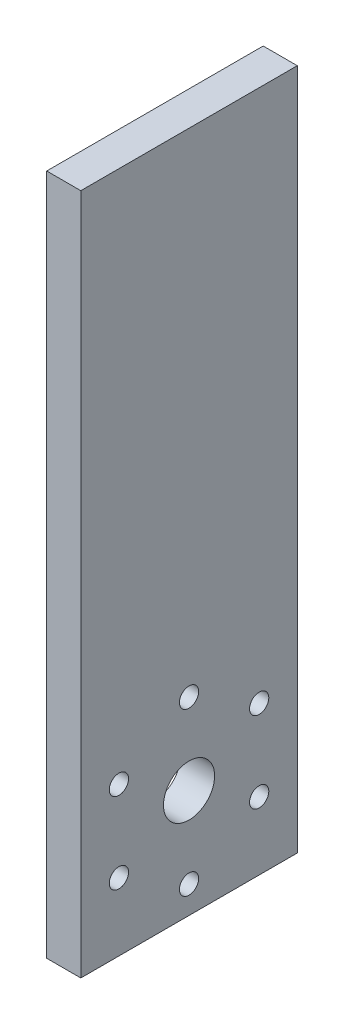
ISO-10303-21;
HEADER;
FILE_DESCRIPTION(('STEP AP214'),'2;1');
FILE_NAME('part.step','',(''),(''),'','','');
FILE_SCHEMA(('AUTOMOTIVE_DESIGN { 1 0 10303 214 1 1 1 1 }'));
ENDSEC;
DATA;
#1=APPLICATION_CONTEXT('core data for automotive mechanical design processes');
#2=APPLICATION_PROTOCOL_DEFINITION('international standard','automotive_design',2000,#1);
#3=PRODUCT_CONTEXT('',#1,'mechanical');
#4=PRODUCT('Part','Part','',(#3));
#5=PRODUCT_RELATED_PRODUCT_CATEGORY('part','',(#4));
#6=PRODUCT_DEFINITION_FORMATION('','',#4);
#7=PRODUCT_DEFINITION_CONTEXT('part definition',#1,'design');
#8=PRODUCT_DEFINITION('design','',#6,#7);
#9=PRODUCT_DEFINITION_SHAPE('','',#8);
#10=(LENGTH_UNIT() NAMED_UNIT(*) SI_UNIT(.MILLI.,.METRE.));
#11=(NAMED_UNIT(*) PLANE_ANGLE_UNIT() SI_UNIT($,.RADIAN.));
#12=(NAMED_UNIT(*) SI_UNIT($,.STERADIAN.) SOLID_ANGLE_UNIT());
#13=UNCERTAINTY_MEASURE_WITH_UNIT(LENGTH_MEASURE(1.E-05),#10,'distance_accuracy_value','');
#14=(GEOMETRIC_REPRESENTATION_CONTEXT(3) GLOBAL_UNCERTAINTY_ASSIGNED_CONTEXT((#13)) GLOBAL_UNIT_ASSIGNED_CONTEXT((#10,
#11,#12)) REPRESENTATION_CONTEXT('',''));
#15=CARTESIAN_POINT('',(0.,0.,0.));
#16=DIRECTION('',(0.,0.,1.));
#17=DIRECTION('',(1.,0.,0.));
#18=AXIS2_PLACEMENT_3D('',#15,#16,#17);
#19=CARTESIAN_POINT('',(0.,80.,0.));
#20=DIRECTION('',(1.,0.,0.));
#21=DIRECTION('',(0.,0.,-1.));
#22=AXIS2_PLACEMENT_3D('',#19,#20,#21);
#23=PLANE('',#22);
#24=CARTESIAN_POINT('',(0.,12.7,12.7));
#25=DIRECTION('',(1.,0.,0.));
#26=DIRECTION('',(0.,0.,-1.));
#27=AXIS2_PLACEMENT_3D('',#24,#25,#26);
#28=CIRCLE('',#27,3.);
#29=CARTESIAN_POINT('',(0.,12.7,9.7));
#30=VERTEX_POINT('',#29);
#31=EDGE_CURVE('E147',#30,#30,#28,.T.);
#32=ORIENTED_EDGE('',*,*,#31,.T.);
#33=EDGE_LOOP('',(#32));
#34=FACE_BOUND('',#33,.T.);
#35=CARTESIAN_POINT('',(0.,22.2,12.7));
#36=DIRECTION('',(1.,0.,0.));
#37=DIRECTION('',(0.,0.,-1.));
#38=AXIS2_PLACEMENT_3D('',#35,#36,#37);
#39=CIRCLE('',#38,1.13029999999999);
#40=CARTESIAN_POINT('',(0.,22.2,11.5697));
#41=VERTEX_POINT('',#40);
#42=EDGE_CURVE('E141',#41,#41,#39,.T.);
#43=ORIENTED_EDGE('',*,*,#42,.T.);
#44=EDGE_LOOP('',(#43));
#45=FACE_BOUND('',#44,.T.);
#46=CARTESIAN_POINT('',(0.,17.4500000000004,4.47275866404757));
#47=DIRECTION('',(1.,0.,0.));
#48=DIRECTION('',(0.,0.,-1.));
#49=AXIS2_PLACEMENT_3D('',#46,#47,#48);
#50=CIRCLE('',#49,1.13029999999999);
#51=CARTESIAN_POINT('',(0.,17.4500000000004,3.34245866404758));
#52=VERTEX_POINT('',#51);
#53=EDGE_CURVE('E135',#52,#52,#50,.T.);
#54=ORIENTED_EDGE('',*,*,#53,.T.);
#55=EDGE_LOOP('',(#54));
#56=FACE_BOUND('',#55,.T.);
#57=CARTESIAN_POINT('',(0.,7.9500000000004,4.47275866404711));
#58=DIRECTION('',(1.,0.,0.));
#59=DIRECTION('',(0.,0.,-1.));
#60=AXIS2_PLACEMENT_3D('',#57,#58,#59);
#61=CIRCLE('',#60,1.13029999999999);
#62=CARTESIAN_POINT('',(0.,7.9500000000004,3.34245866404712));
#63=VERTEX_POINT('',#62);
#64=EDGE_CURVE('E129',#63,#63,#61,.T.);
#65=ORIENTED_EDGE('',*,*,#64,.T.);
#66=EDGE_LOOP('',(#65));
#67=FACE_BOUND('',#66,.T.);
#68=CARTESIAN_POINT('',(0.,3.2,12.6999999999991));
#69=DIRECTION('',(1.,0.,0.));
#70=DIRECTION('',(0.,0.,-1.));
#71=AXIS2_PLACEMENT_3D('',#68,#69,#70);
#72=CIRCLE('',#71,1.13029999999999);
#73=CARTESIAN_POINT('',(0.,3.2,11.5696999999991));
#74=VERTEX_POINT('',#73);
#75=EDGE_CURVE('E123',#74,#74,#72,.T.);
#76=ORIENTED_EDGE('',*,*,#75,.T.);
#77=EDGE_LOOP('',(#76));
#78=FACE_BOUND('',#77,.T.);
#79=CARTESIAN_POINT('',(0.,7.94999999999964,20.9272413359515));
#80=DIRECTION('',(1.,0.,0.));
#81=DIRECTION('',(0.,0.,-1.));
#82=AXIS2_PLACEMENT_3D('',#79,#80,#81);
#83=CIRCLE('',#82,1.13029999999999);
#84=CARTESIAN_POINT('',(0.,7.94999999999964,19.7969413359515));
#85=VERTEX_POINT('',#84);
#86=EDGE_CURVE('E117',#85,#85,#83,.T.);
#87=ORIENTED_EDGE('',*,*,#86,.T.);
#88=EDGE_LOOP('',(#87));
#89=FACE_BOUND('',#88,.T.);
#90=CARTESIAN_POINT('',(0.,17.4499999999997,20.9272413359519));
#91=DIRECTION('',(1.,0.,0.));
#92=DIRECTION('',(0.,0.,-1.));
#93=AXIS2_PLACEMENT_3D('',#90,#91,#92);
#94=CIRCLE('',#93,1.13029999999999);
#95=CARTESIAN_POINT('',(0.,17.4499999999997,19.7969413359519));
#96=VERTEX_POINT('',#95);
#97=EDGE_CURVE('E101',#96,#96,#94,.T.);
#98=ORIENTED_EDGE('',*,*,#97,.T.);
#99=EDGE_LOOP('',(#98));
#100=FACE_BOUND('',#99,.T.);
#101=DIRECTION('',(0.,0.,1.));
#102=VECTOR('',#101,1.);
#103=CARTESIAN_POINT('',(0.,0.,0.));
#104=LINE('',#103,#102);
#105=CARTESIAN_POINT('',(0.,0.,0.));
#106=VERTEX_POINT('',#105);
#107=CARTESIAN_POINT('',(0.,0.,25.4));
#108=VERTEX_POINT('',#107);
#109=EDGE_CURVE('E98',#106,#108,#104,.T.);
#110=ORIENTED_EDGE('',*,*,#109,.T.);
#111=DIRECTION('',(0.,-1.,0.));
#112=VECTOR('',#111,1.);
#113=CARTESIAN_POINT('',(0.,80.,25.4));
#114=LINE('',#113,#112);
#115=CARTESIAN_POINT('',(0.,80.,25.4));
#116=VERTEX_POINT('',#115);
#117=EDGE_CURVE('E11',#116,#108,#114,.T.);
#118=ORIENTED_EDGE('',*,*,#117,.F.);
#119=DIRECTION('',(0.,0.,1.));
#120=VECTOR('',#119,1.);
#121=CARTESIAN_POINT('',(0.,80.,0.));
#122=LINE('',#121,#120);
#123=CARTESIAN_POINT('',(0.,80.,0.));
#124=VERTEX_POINT('',#123);
#125=EDGE_CURVE('E86',#124,#116,#122,.T.);
#126=ORIENTED_EDGE('',*,*,#125,.F.);
#127=DIRECTION('',(0.,-1.,0.));
#128=VECTOR('',#127,1.);
#129=CARTESIAN_POINT('',(0.,80.,0.));
#130=LINE('',#129,#128);
#131=EDGE_CURVE('E94',#124,#106,#130,.T.);
#132=ORIENTED_EDGE('',*,*,#131,.T.);
#133=EDGE_LOOP('',(#110,#118,#126,#132));
#134=FACE_BOUND('',#133,.T.);
#135=ADVANCED_FACE('F35',(#34,#45,#56,#67,#78,#89,#100,#134),#23,.F.);
#136=CARTESIAN_POINT('',(0.,80.,25.4));
#137=DIRECTION('',(0.,0.,-1.));
#138=DIRECTION('',(-1.,0.,0.));
#139=AXIS2_PLACEMENT_3D('',#136,#137,#138);
#140=PLANE('',#139);
#141=DIRECTION('',(1.,0.,0.));
#142=VECTOR('',#141,1.);
#143=CARTESIAN_POINT('',(0.,0.,25.4));
#144=LINE('',#143,#142);
#145=CARTESIAN_POINT('',(4.,0.,25.4));
#146=VERTEX_POINT('',#145);
#147=EDGE_CURVE('E90',#108,#146,#144,.T.);
#148=ORIENTED_EDGE('',*,*,#147,.T.);
#149=DIRECTION('',(0.,-1.,0.));
#150=VECTOR('',#149,1.);
#151=CARTESIAN_POINT('',(4.,80.,25.4));
#152=LINE('',#151,#150);
#153=CARTESIAN_POINT('',(4.,80.,25.4));
#154=VERTEX_POINT('',#153);
#155=EDGE_CURVE('E43',#154,#146,#152,.T.);
#156=ORIENTED_EDGE('',*,*,#155,.F.);
#157=DIRECTION('',(1.,0.,0.));
#158=VECTOR('',#157,1.);
#159=CARTESIAN_POINT('',(0.,80.,25.4));
#160=LINE('',#159,#158);
#161=EDGE_CURVE('E81',#116,#154,#160,.T.);
#162=ORIENTED_EDGE('',*,*,#161,.F.);
#163=ORIENTED_EDGE('',*,*,#117,.T.);
#164=EDGE_LOOP('',(#148,#156,#162,#163));
#165=FACE_BOUND('',#164,.T.);
#166=ADVANCED_FACE('F89',(#165),#140,.F.);
#167=CARTESIAN_POINT('',(4.,80.,0.));
#168=DIRECTION('',(-1.,0.,0.));
#169=DIRECTION('',(0.,0.,1.));
#170=AXIS2_PLACEMENT_3D('',#167,#168,#169);
#171=PLANE('',#170);
#172=CARTESIAN_POINT('',(4.,12.7,12.7));
#173=DIRECTION('',(1.,0.,0.));
#174=DIRECTION('',(0.,0.,-1.));
#175=AXIS2_PLACEMENT_3D('',#172,#173,#174);
#176=CIRCLE('',#175,3.);
#177=CARTESIAN_POINT('',(4.,12.7,9.7));
#178=VERTEX_POINT('',#177);
#179=EDGE_CURVE('E150',#178,#178,#176,.T.);
#180=ORIENTED_EDGE('',*,*,#179,.F.);
#181=EDGE_LOOP('',(#180));
#182=FACE_BOUND('',#181,.T.);
#183=CARTESIAN_POINT('',(4.,22.2,12.7));
#184=DIRECTION('',(1.,0.,0.));
#185=DIRECTION('',(0.,0.,-1.));
#186=AXIS2_PLACEMENT_3D('',#183,#184,#185);
#187=CIRCLE('',#186,1.13029999999999);
#188=CARTESIAN_POINT('',(4.,22.2,11.5697));
#189=VERTEX_POINT('',#188);
#190=EDGE_CURVE('E144',#189,#189,#187,.T.);
#191=ORIENTED_EDGE('',*,*,#190,.F.);
#192=EDGE_LOOP('',(#191));
#193=FACE_BOUND('',#192,.T.);
#194=CARTESIAN_POINT('',(4.,17.4500000000004,4.47275866404757));
#195=DIRECTION('',(1.,0.,0.));
#196=DIRECTION('',(0.,0.,-1.));
#197=AXIS2_PLACEMENT_3D('',#194,#195,#196);
#198=CIRCLE('',#197,1.13029999999999);
#199=CARTESIAN_POINT('',(4.,17.4500000000004,3.34245866404758));
#200=VERTEX_POINT('',#199);
#201=EDGE_CURVE('E138',#200,#200,#198,.T.);
#202=ORIENTED_EDGE('',*,*,#201,.F.);
#203=EDGE_LOOP('',(#202));
#204=FACE_BOUND('',#203,.T.);
#205=CARTESIAN_POINT('',(4.,7.9500000000004,4.47275866404711));
#206=DIRECTION('',(1.,0.,0.));
#207=DIRECTION('',(0.,0.,-1.));
#208=AXIS2_PLACEMENT_3D('',#205,#206,#207);
#209=CIRCLE('',#208,1.13029999999999);
#210=CARTESIAN_POINT('',(4.,7.9500000000004,3.34245866404712));
#211=VERTEX_POINT('',#210);
#212=EDGE_CURVE('E132',#211,#211,#209,.T.);
#213=ORIENTED_EDGE('',*,*,#212,.F.);
#214=EDGE_LOOP('',(#213));
#215=FACE_BOUND('',#214,.T.);
#216=CARTESIAN_POINT('',(4.,3.2,12.6999999999991));
#217=DIRECTION('',(1.,0.,0.));
#218=DIRECTION('',(0.,0.,-1.));
#219=AXIS2_PLACEMENT_3D('',#216,#217,#218);
#220=CIRCLE('',#219,1.13029999999999);
#221=CARTESIAN_POINT('',(4.,3.2,11.5696999999991));
#222=VERTEX_POINT('',#221);
#223=EDGE_CURVE('E126',#222,#222,#220,.T.);
#224=ORIENTED_EDGE('',*,*,#223,.F.);
#225=EDGE_LOOP('',(#224));
#226=FACE_BOUND('',#225,.T.);
#227=CARTESIAN_POINT('',(4.,7.94999999999964,20.9272413359515));
#228=DIRECTION('',(1.,0.,0.));
#229=DIRECTION('',(0.,0.,-1.));
#230=AXIS2_PLACEMENT_3D('',#227,#228,#229);
#231=CIRCLE('',#230,1.13029999999999);
#232=CARTESIAN_POINT('',(4.,7.94999999999964,19.7969413359515));
#233=VERTEX_POINT('',#232);
#234=EDGE_CURVE('E120',#233,#233,#231,.T.);
#235=ORIENTED_EDGE('',*,*,#234,.F.);
#236=EDGE_LOOP('',(#235));
#237=FACE_BOUND('',#236,.T.);
#238=CARTESIAN_POINT('',(4.,17.4499999999997,20.9272413359519));
#239=DIRECTION('',(1.,0.,0.));
#240=DIRECTION('',(0.,0.,-1.));
#241=AXIS2_PLACEMENT_3D('',#238,#239,#240);
#242=CIRCLE('',#241,1.13029999999999);
#243=CARTESIAN_POINT('',(4.,17.4499999999997,19.7969413359519));
#244=VERTEX_POINT('',#243);
#245=EDGE_CURVE('E114',#244,#244,#242,.T.);
#246=ORIENTED_EDGE('',*,*,#245,.F.);
#247=EDGE_LOOP('',(#246));
#248=FACE_BOUND('',#247,.T.);
#249=DIRECTION('',(0.,0.,-1.));
#250=VECTOR('',#249,1.);
#251=CARTESIAN_POINT('',(4.,0.,0.));
#252=LINE('',#251,#250);
#253=CARTESIAN_POINT('',(4.,0.,0.));
#254=VERTEX_POINT('',#253);
#255=EDGE_CURVE('E68',#146,#254,#252,.T.);
#256=ORIENTED_EDGE('',*,*,#255,.T.);
#257=DIRECTION('',(0.,-1.,0.));
#258=VECTOR('',#257,1.);
#259=CARTESIAN_POINT('',(4.,80.,0.));
#260=LINE('',#259,#258);
#261=CARTESIAN_POINT('',(4.,80.,0.));
#262=VERTEX_POINT('',#261);
#263=EDGE_CURVE('E91',#262,#254,#260,.T.);
#264=ORIENTED_EDGE('',*,*,#263,.F.);
#265=DIRECTION('',(0.,0.,-1.));
#266=VECTOR('',#265,1.);
#267=CARTESIAN_POINT('',(4.,80.,0.));
#268=LINE('',#267,#266);
#269=EDGE_CURVE('E84',#154,#262,#268,.T.);
#270=ORIENTED_EDGE('',*,*,#269,.F.);
#271=ORIENTED_EDGE('',*,*,#155,.T.);
#272=EDGE_LOOP('',(#256,#264,#270,#271));
#273=FACE_BOUND('',#272,.T.);
#274=ADVANCED_FACE('F92',(#182,#193,#204,#215,#226,#237,#248,#273),#171,.F.);
#275=CARTESIAN_POINT('',(0.,80.,0.));
#276=DIRECTION('',(0.,0.,1.));
#277=DIRECTION('',(1.,0.,0.));
#278=AXIS2_PLACEMENT_3D('',#275,#276,#277);
#279=PLANE('',#278);
#280=DIRECTION('',(-1.,0.,0.));
#281=VECTOR('',#280,1.);
#282=CARTESIAN_POINT('',(0.,0.,0.));
#283=LINE('',#282,#281);
#284=EDGE_CURVE('E74',#254,#106,#283,.T.);
#285=ORIENTED_EDGE('',*,*,#284,.T.);
#286=ORIENTED_EDGE('',*,*,#131,.F.);
#287=DIRECTION('',(-1.,0.,0.));
#288=VECTOR('',#287,1.);
#289=CARTESIAN_POINT('',(0.,80.,0.));
#290=LINE('',#289,#288);
#291=EDGE_CURVE('E51',#262,#124,#290,.T.);
#292=ORIENTED_EDGE('',*,*,#291,.F.);
#293=ORIENTED_EDGE('',*,*,#263,.T.);
#294=EDGE_LOOP('',(#285,#286,#292,#293));
#295=FACE_BOUND('',#294,.T.);
#296=ADVANCED_FACE('F106',(#295),#279,.F.);
#297=CARTESIAN_POINT('',(0.,80.,0.));
#298=DIRECTION('',(0.,1.,0.));
#299=DIRECTION('',(0.,0.,1.));
#300=AXIS2_PLACEMENT_3D('',#297,#298,#299);
#301=PLANE('',#300);
#302=ORIENTED_EDGE('',*,*,#125,.T.);
#303=ORIENTED_EDGE('',*,*,#161,.T.);
#304=ORIENTED_EDGE('',*,*,#269,.T.);
#305=ORIENTED_EDGE('',*,*,#291,.T.);
#306=EDGE_LOOP('',(#302,#303,#304,#305));
#307=FACE_BOUND('',#306,.T.);
#308=ADVANCED_FACE('F82',(#307),#301,.T.);
#309=CARTESIAN_POINT('',(0.,0.,0.));
#310=DIRECTION('',(0.,1.,0.));
#311=DIRECTION('',(0.,0.,1.));
#312=AXIS2_PLACEMENT_3D('',#309,#310,#311);
#313=PLANE('',#312);
#314=ORIENTED_EDGE('',*,*,#109,.F.);
#315=ORIENTED_EDGE('',*,*,#284,.F.);
#316=ORIENTED_EDGE('',*,*,#255,.F.);
#317=ORIENTED_EDGE('',*,*,#147,.F.);
#318=EDGE_LOOP('',(#314,#315,#316,#317));
#319=FACE_BOUND('',#318,.T.);
#320=ADVANCED_FACE('F109',(#319),#313,.F.);
#321=CARTESIAN_POINT('',(4.,17.4499999999997,20.9272413359519));
#322=DIRECTION('',(1.,0.,0.));
#323=DIRECTION('',(0.,0.,-1.));
#324=AXIS2_PLACEMENT_3D('',#321,#322,#323);
#325=CYLINDRICAL_SURFACE('',#324,1.13029999999999);
#326=ORIENTED_EDGE('',*,*,#245,.T.);
#327=EDGE_LOOP('',(#326));
#328=FACE_BOUND('',#327,.T.);
#329=ORIENTED_EDGE('',*,*,#97,.F.);
#330=EDGE_LOOP('',(#329));
#331=FACE_BOUND('',#330,.T.);
#332=ADVANCED_FACE('F172',(#328,#331),#325,.F.);
#333=CARTESIAN_POINT('',(4.,7.94999999999964,20.9272413359515));
#334=DIRECTION('',(1.,0.,0.));
#335=DIRECTION('',(0.,0.,-1.));
#336=AXIS2_PLACEMENT_3D('',#333,#334,#335);
#337=CYLINDRICAL_SURFACE('',#336,1.13029999999999);
#338=ORIENTED_EDGE('',*,*,#234,.T.);
#339=EDGE_LOOP('',(#338));
#340=FACE_BOUND('',#339,.T.);
#341=ORIENTED_EDGE('',*,*,#86,.F.);
#342=EDGE_LOOP('',(#341));
#343=FACE_BOUND('',#342,.T.);
#344=ADVANCED_FACE('F175',(#340,#343),#337,.F.);
#345=CARTESIAN_POINT('',(4.,3.2,12.6999999999991));
#346=DIRECTION('',(1.,0.,0.));
#347=DIRECTION('',(0.,0.,-1.));
#348=AXIS2_PLACEMENT_3D('',#345,#346,#347);
#349=CYLINDRICAL_SURFACE('',#348,1.13029999999999);
#350=ORIENTED_EDGE('',*,*,#223,.T.);
#351=EDGE_LOOP('',(#350));
#352=FACE_BOUND('',#351,.T.);
#353=ORIENTED_EDGE('',*,*,#75,.F.);
#354=EDGE_LOOP('',(#353));
#355=FACE_BOUND('',#354,.T.);
#356=ADVANCED_FACE('F197',(#352,#355),#349,.F.);
#357=CARTESIAN_POINT('',(4.,7.9500000000004,4.47275866404711));
#358=DIRECTION('',(1.,0.,0.));
#359=DIRECTION('',(0.,0.,-1.));
#360=AXIS2_PLACEMENT_3D('',#357,#358,#359);
#361=CYLINDRICAL_SURFACE('',#360,1.13029999999999);
#362=ORIENTED_EDGE('',*,*,#212,.T.);
#363=EDGE_LOOP('',(#362));
#364=FACE_BOUND('',#363,.T.);
#365=ORIENTED_EDGE('',*,*,#64,.F.);
#366=EDGE_LOOP('',(#365));
#367=FACE_BOUND('',#366,.T.);
#368=ADVANCED_FACE('F203',(#364,#367),#361,.F.);
#369=CARTESIAN_POINT('',(4.,17.4500000000004,4.47275866404757));
#370=DIRECTION('',(1.,0.,0.));
#371=DIRECTION('',(0.,0.,-1.));
#372=AXIS2_PLACEMENT_3D('',#369,#370,#371);
#373=CYLINDRICAL_SURFACE('',#372,1.13029999999999);
#374=ORIENTED_EDGE('',*,*,#201,.T.);
#375=EDGE_LOOP('',(#374));
#376=FACE_BOUND('',#375,.T.);
#377=ORIENTED_EDGE('',*,*,#53,.F.);
#378=EDGE_LOOP('',(#377));
#379=FACE_BOUND('',#378,.T.);
#380=ADVANCED_FACE('F249',(#376,#379),#373,.F.);
#381=CARTESIAN_POINT('',(4.,22.2,12.7));
#382=DIRECTION('',(1.,0.,0.));
#383=DIRECTION('',(0.,0.,-1.));
#384=AXIS2_PLACEMENT_3D('',#381,#382,#383);
#385=CYLINDRICAL_SURFACE('',#384,1.13029999999999);
#386=ORIENTED_EDGE('',*,*,#190,.T.);
#387=EDGE_LOOP('',(#386));
#388=FACE_BOUND('',#387,.T.);
#389=ORIENTED_EDGE('',*,*,#42,.F.);
#390=EDGE_LOOP('',(#389));
#391=FACE_BOUND('',#390,.T.);
#392=ADVANCED_FACE('F258',(#388,#391),#385,.F.);
#393=CARTESIAN_POINT('',(-76.,12.7,12.7));
#394=DIRECTION('',(1.,0.,0.));
#395=DIRECTION('',(0.,0.,-1.));
#396=AXIS2_PLACEMENT_3D('',#393,#394,#395);
#397=CYLINDRICAL_SURFACE('',#396,3.);
#398=ORIENTED_EDGE('',*,*,#179,.T.);
#399=EDGE_LOOP('',(#398));
#400=FACE_BOUND('',#399,.T.);
#401=ORIENTED_EDGE('',*,*,#31,.F.);
#402=EDGE_LOOP('',(#401));
#403=FACE_BOUND('',#402,.T.);
#404=ADVANCED_FACE('F154',(#400,#403),#397,.F.);
#405=CLOSED_SHELL('',(#135,#166,#274,#296,#308,#320,#332,#344,#356,#368,#380,#392,#404));
#406=MANIFOLD_SOLID_BREP('B2',#405);
#407=ADVANCED_BREP_SHAPE_REPRESENTATION('',(#18,#406),#14);
#408=SHAPE_DEFINITION_REPRESENTATION(#9,#407);
ENDSEC;
END-ISO-10303-21;
